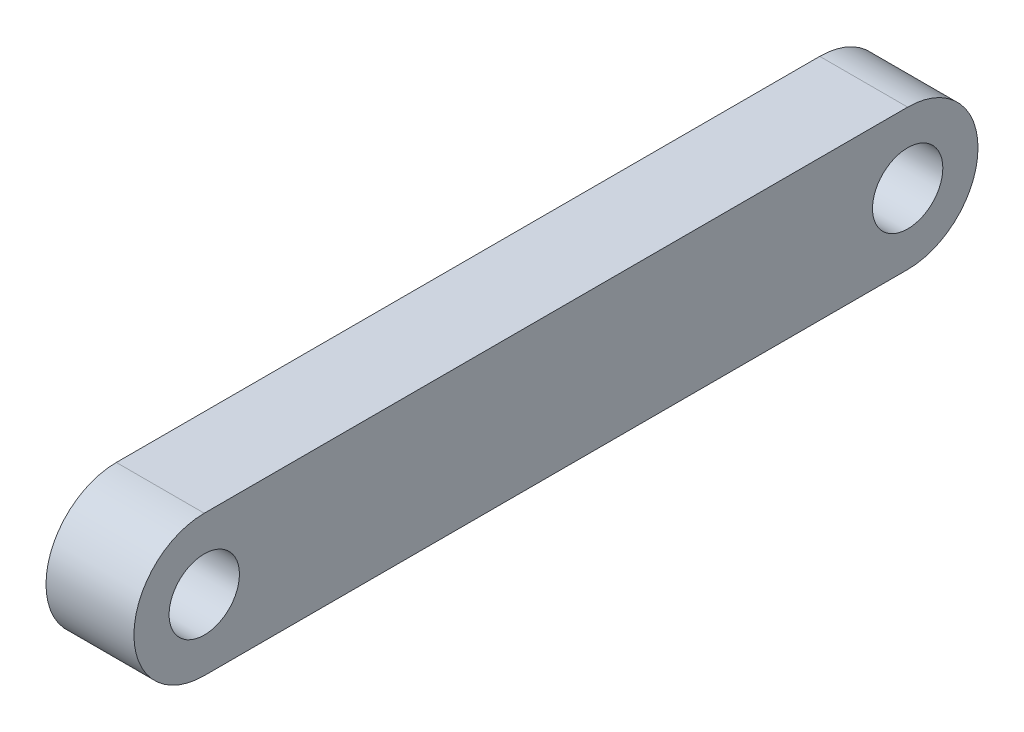
ISO-10303-21;
HEADER;
FILE_DESCRIPTION(('STEP AP214'),'2;1');
FILE_NAME('part.step','',(''),(''),'','','');
FILE_SCHEMA(('AUTOMOTIVE_DESIGN { 1 0 10303 214 1 1 1 1 }'));
ENDSEC;
DATA;
#1=APPLICATION_CONTEXT('core data for automotive mechanical design processes');
#2=APPLICATION_PROTOCOL_DEFINITION('international standard','automotive_design',2000,#1);
#3=PRODUCT_CONTEXT('',#1,'mechanical');
#4=PRODUCT('Part','Part','',(#3));
#5=PRODUCT_RELATED_PRODUCT_CATEGORY('part','',(#4));
#6=PRODUCT_DEFINITION_FORMATION('','',#4);
#7=PRODUCT_DEFINITION_CONTEXT('part definition',#1,'design');
#8=PRODUCT_DEFINITION('design','',#6,#7);
#9=PRODUCT_DEFINITION_SHAPE('','',#8);
#10=(LENGTH_UNIT() NAMED_UNIT(*) SI_UNIT(.MILLI.,.METRE.));
#11=(NAMED_UNIT(*) PLANE_ANGLE_UNIT() SI_UNIT($,.RADIAN.));
#12=(NAMED_UNIT(*) SI_UNIT($,.STERADIAN.) SOLID_ANGLE_UNIT());
#13=UNCERTAINTY_MEASURE_WITH_UNIT(LENGTH_MEASURE(1.E-05),#10,'distance_accuracy_value','');
#14=(GEOMETRIC_REPRESENTATION_CONTEXT(3) GLOBAL_UNCERTAINTY_ASSIGNED_CONTEXT((#13)) GLOBAL_UNIT_ASSIGNED_CONTEXT((#10,
#11,#12)) REPRESENTATION_CONTEXT('',''));
#15=CARTESIAN_POINT('',(0.,0.,0.));
#16=DIRECTION('',(0.,0.,1.));
#17=DIRECTION('',(1.,0.,0.));
#18=AXIS2_PLACEMENT_3D('',#15,#16,#17);
#19=CARTESIAN_POINT('',(10.,-7.99999999999999,0.));
#20=DIRECTION('',(0.,1.,0.));
#21=DIRECTION('',(0.,0.,1.));
#22=AXIS2_PLACEMENT_3D('',#19,#20,#21);
#23=PLANE('',#22);
#24=DIRECTION('',(0.,0.,-1.));
#25=VECTOR('',#24,1.);
#26=CARTESIAN_POINT('',(0.,-7.99999999999999,0.));
#27=LINE('',#26,#25);
#28=CARTESIAN_POINT('',(0.,-7.99999999999999,40.));
#29=VERTEX_POINT('',#28);
#30=CARTESIAN_POINT('',(0.,-7.99999999999999,-40.));
#31=VERTEX_POINT('',#30);
#32=EDGE_CURVE('E109',#29,#31,#27,.T.);
#33=ORIENTED_EDGE('',*,*,#32,.T.);
#34=DIRECTION('',(-1.,0.,0.));
#35=VECTOR('',#34,1.);
#36=CARTESIAN_POINT('',(10.,-7.99999999999999,-40.));
#37=LINE('',#36,#35);
#38=CARTESIAN_POINT('',(10.,-7.99999999999999,-40.));
#39=VERTEX_POINT('',#38);
#40=EDGE_CURVE('E11',#39,#31,#37,.T.);
#41=ORIENTED_EDGE('',*,*,#40,.F.);
#42=DIRECTION('',(0.,0.,-1.));
#43=VECTOR('',#42,1.);
#44=CARTESIAN_POINT('',(10.,-7.99999999999999,0.));
#45=LINE('',#44,#43);
#46=CARTESIAN_POINT('',(10.,-7.99999999999999,40.));
#47=VERTEX_POINT('',#46);
#48=EDGE_CURVE('E89',#47,#39,#45,.T.);
#49=ORIENTED_EDGE('',*,*,#48,.F.);
#50=DIRECTION('',(-1.,0.,0.));
#51=VECTOR('',#50,1.);
#52=CARTESIAN_POINT('',(10.,-7.99999999999999,40.));
#53=LINE('',#52,#51);
#54=EDGE_CURVE('E56',#47,#29,#53,.T.);
#55=ORIENTED_EDGE('',*,*,#54,.T.);
#56=EDGE_LOOP('',(#33,#41,#49,#55));
#57=FACE_BOUND('',#56,.T.);
#58=ADVANCED_FACE('F39',(#57),#23,.F.);
#59=CARTESIAN_POINT('',(10.,0.,-40.));
#60=DIRECTION('',(-1.,0.,0.));
#61=DIRECTION('',(0.,0.,1.));
#62=AXIS2_PLACEMENT_3D('',#59,#60,#61);
#63=CYLINDRICAL_SURFACE('',#62,7.99999999999999);
#64=CARTESIAN_POINT('',(0.,0.,-40.));
#65=DIRECTION('',(1.,0.,0.));
#66=DIRECTION('',(0.,0.,-1.));
#67=AXIS2_PLACEMENT_3D('',#64,#65,#66);
#68=CIRCLE('',#67,7.99999999999999);
#69=CARTESIAN_POINT('',(0.,7.99999999999998,-40.));
#70=VERTEX_POINT('',#69);
#71=EDGE_CURVE('E94',#31,#70,#68,.T.);
#72=ORIENTED_EDGE('',*,*,#71,.T.);
#73=DIRECTION('',(-1.,0.,0.));
#74=VECTOR('',#73,1.);
#75=CARTESIAN_POINT('',(10.,7.99999999999998,-40.));
#76=LINE('',#75,#74);
#77=CARTESIAN_POINT('',(10.,7.99999999999998,-40.));
#78=VERTEX_POINT('',#77);
#79=EDGE_CURVE('E48',#78,#70,#76,.T.);
#80=ORIENTED_EDGE('',*,*,#79,.F.);
#81=CARTESIAN_POINT('',(10.,0.,-40.));
#82=DIRECTION('',(1.,0.,0.));
#83=DIRECTION('',(0.,0.,-1.));
#84=AXIS2_PLACEMENT_3D('',#81,#82,#83);
#85=CIRCLE('',#84,7.99999999999999);
#86=EDGE_CURVE('E81',#39,#78,#85,.T.);
#87=ORIENTED_EDGE('',*,*,#86,.F.);
#88=ORIENTED_EDGE('',*,*,#40,.T.);
#89=EDGE_LOOP('',(#72,#80,#87,#88));
#90=FACE_BOUND('',#89,.T.);
#91=ADVANCED_FACE('F93',(#90),#63,.T.);
#92=CARTESIAN_POINT('',(10.,7.99999999999998,0.));
#93=DIRECTION('',(0.,1.,0.));
#94=DIRECTION('',(0.,0.,1.));
#95=AXIS2_PLACEMENT_3D('',#92,#93,#94);
#96=PLANE('',#95);
#97=DIRECTION('',(0.,0.,-1.));
#98=VECTOR('',#97,1.);
#99=CARTESIAN_POINT('',(0.,7.99999999999998,0.));
#100=LINE('',#99,#98);
#101=CARTESIAN_POINT('',(0.,7.99999999999998,40.));
#102=VERTEX_POINT('',#101);
#103=EDGE_CURVE('E112',#102,#70,#100,.T.);
#104=ORIENTED_EDGE('',*,*,#103,.F.);
#105=DIRECTION('',(-1.,0.,0.));
#106=VECTOR('',#105,1.);
#107=CARTESIAN_POINT('',(10.,7.99999999999998,40.));
#108=LINE('',#107,#106);
#109=CARTESIAN_POINT('',(10.,7.99999999999998,40.));
#110=VERTEX_POINT('',#109);
#111=EDGE_CURVE('E70',#110,#102,#108,.T.);
#112=ORIENTED_EDGE('',*,*,#111,.F.);
#113=DIRECTION('',(0.,0.,-1.));
#114=VECTOR('',#113,1.);
#115=CARTESIAN_POINT('',(10.,7.99999999999998,0.));
#116=LINE('',#115,#114);
#117=EDGE_CURVE('E88',#110,#78,#116,.T.);
#118=ORIENTED_EDGE('',*,*,#117,.T.);
#119=ORIENTED_EDGE('',*,*,#79,.T.);
#120=EDGE_LOOP('',(#104,#112,#118,#119));
#121=FACE_BOUND('',#120,.T.);
#122=ADVANCED_FACE('F97',(#121),#96,.T.);
#123=CARTESIAN_POINT('',(10.,0.,40.));
#124=DIRECTION('',(-1.,0.,0.));
#125=DIRECTION('',(0.,0.,1.));
#126=AXIS2_PLACEMENT_3D('',#123,#124,#125);
#127=CYLINDRICAL_SURFACE('',#126,4.00000000000001);
#128=CARTESIAN_POINT('',(10.,0.,40.));
#129=DIRECTION('',(1.,0.,0.));
#130=DIRECTION('',(0.,0.,-1.));
#131=AXIS2_PLACEMENT_3D('',#128,#129,#130);
#132=CIRCLE('',#131,4.00000000000001);
#133=CARTESIAN_POINT('',(10.,0.,36.));
#134=VERTEX_POINT('',#133);
#135=EDGE_CURVE('E121',#134,#134,#132,.T.);
#136=ORIENTED_EDGE('',*,*,#135,.T.);
#137=EDGE_LOOP('',(#136));
#138=FACE_BOUND('',#137,.T.);
#139=CARTESIAN_POINT('',(0.,0.,40.));
#140=DIRECTION('',(1.,0.,0.));
#141=DIRECTION('',(0.,0.,-1.));
#142=AXIS2_PLACEMENT_3D('',#139,#140,#141);
#143=CIRCLE('',#142,4.00000000000001);
#144=CARTESIAN_POINT('',(0.,0.,36.));
#145=VERTEX_POINT('',#144);
#146=EDGE_CURVE('E106',#145,#145,#143,.T.);
#147=ORIENTED_EDGE('',*,*,#146,.F.);
#148=EDGE_LOOP('',(#147));
#149=FACE_BOUND('',#148,.T.);
#150=ADVANCED_FACE('F129',(#138,#149),#127,.F.);
#151=CARTESIAN_POINT('',(10.,0.,-40.));
#152=DIRECTION('',(-1.,0.,0.));
#153=DIRECTION('',(0.,0.,1.));
#154=AXIS2_PLACEMENT_3D('',#151,#152,#153);
#155=CYLINDRICAL_SURFACE('',#154,4.00000000000001);
#156=CARTESIAN_POINT('',(10.,0.,-40.));
#157=DIRECTION('',(1.,0.,0.));
#158=DIRECTION('',(0.,0.,-1.));
#159=AXIS2_PLACEMENT_3D('',#156,#157,#158);
#160=CIRCLE('',#159,4.00000000000001);
#161=CARTESIAN_POINT('',(10.,0.,-44.));
#162=VERTEX_POINT('',#161);
#163=EDGE_CURVE('E117',#162,#162,#160,.F.);
#164=ORIENTED_EDGE('',*,*,#163,.F.);
#165=EDGE_LOOP('',(#164));
#166=FACE_BOUND('',#165,.T.);
#167=CARTESIAN_POINT('',(0.,0.,-40.));
#168=DIRECTION('',(1.,0.,0.));
#169=DIRECTION('',(0.,0.,-1.));
#170=AXIS2_PLACEMENT_3D('',#167,#168,#169);
#171=CIRCLE('',#170,4.00000000000001);
#172=CARTESIAN_POINT('',(0.,0.,-44.));
#173=VERTEX_POINT('',#172);
#174=EDGE_CURVE('E103',#173,#173,#171,.F.);
#175=ORIENTED_EDGE('',*,*,#174,.T.);
#176=EDGE_LOOP('',(#175));
#177=FACE_BOUND('',#176,.T.);
#178=ADVANCED_FACE('F41',(#166,#177),#155,.F.);
#179=CARTESIAN_POINT('',(10.,0.,40.));
#180=DIRECTION('',(-1.,0.,0.));
#181=DIRECTION('',(0.,0.,1.));
#182=AXIS2_PLACEMENT_3D('',#179,#180,#181);
#183=CYLINDRICAL_SURFACE('',#182,7.99999999999999);
#184=CARTESIAN_POINT('',(0.,0.,40.));
#185=DIRECTION('',(1.,0.,0.));
#186=DIRECTION('',(0.,0.,-1.));
#187=AXIS2_PLACEMENT_3D('',#184,#185,#186);
#188=CIRCLE('',#187,7.99999999999999);
#189=EDGE_CURVE('E114',#29,#102,#188,.F.);
#190=ORIENTED_EDGE('',*,*,#189,.F.);
#191=ORIENTED_EDGE('',*,*,#54,.F.);
#192=CARTESIAN_POINT('',(10.,0.,40.));
#193=DIRECTION('',(1.,0.,0.));
#194=DIRECTION('',(0.,0.,-1.));
#195=AXIS2_PLACEMENT_3D('',#192,#193,#194);
#196=CIRCLE('',#195,7.99999999999999);
#197=EDGE_CURVE('E98',#47,#110,#196,.F.);
#198=ORIENTED_EDGE('',*,*,#197,.T.);
#199=ORIENTED_EDGE('',*,*,#111,.T.);
#200=EDGE_LOOP('',(#190,#191,#198,#199));
#201=FACE_BOUND('',#200,.T.);
#202=ADVANCED_FACE('F134',(#201),#183,.T.);
#203=CARTESIAN_POINT('',(10.,0.,0.));
#204=DIRECTION('',(1.,0.,0.));
#205=DIRECTION('',(0.,0.,-1.));
#206=AXIS2_PLACEMENT_3D('',#203,#204,#205);
#207=PLANE('',#206);
#208=ORIENTED_EDGE('',*,*,#163,.T.);
#209=EDGE_LOOP('',(#208));
#210=FACE_BOUND('',#209,.T.);
#211=ORIENTED_EDGE('',*,*,#135,.F.);
#212=EDGE_LOOP('',(#211));
#213=FACE_BOUND('',#212,.T.);
#214=ORIENTED_EDGE('',*,*,#48,.T.);
#215=ORIENTED_EDGE('',*,*,#86,.T.);
#216=ORIENTED_EDGE('',*,*,#117,.F.);
#217=ORIENTED_EDGE('',*,*,#197,.F.);
#218=EDGE_LOOP('',(#214,#215,#216,#217));
#219=FACE_BOUND('',#218,.T.);
#220=ADVANCED_FACE('F85',(#210,#213,#219),#207,.T.);
#221=CARTESIAN_POINT('',(0.,0.,0.));
#222=DIRECTION('',(1.,0.,0.));
#223=DIRECTION('',(0.,0.,-1.));
#224=AXIS2_PLACEMENT_3D('',#221,#222,#223);
#225=PLANE('',#224);
#226=ORIENTED_EDGE('',*,*,#174,.F.);
#227=EDGE_LOOP('',(#226));
#228=FACE_BOUND('',#227,.T.);
#229=ORIENTED_EDGE('',*,*,#146,.T.);
#230=EDGE_LOOP('',(#229));
#231=FACE_BOUND('',#230,.T.);
#232=ORIENTED_EDGE('',*,*,#32,.F.);
#233=ORIENTED_EDGE('',*,*,#189,.T.);
#234=ORIENTED_EDGE('',*,*,#103,.T.);
#235=ORIENTED_EDGE('',*,*,#71,.F.);
#236=EDGE_LOOP('',(#232,#233,#234,#235));
#237=FACE_BOUND('',#236,.T.);
#238=ADVANCED_FACE('F133',(#228,#231,#237),#225,.F.);
#239=CLOSED_SHELL('',(#58,#91,#122,#150,#178,#202,#220,#238));
#240=MANIFOLD_SOLID_BREP('B2',#239);
#241=ADVANCED_BREP_SHAPE_REPRESENTATION('',(#18,#240),#14);
#242=SHAPE_DEFINITION_REPRESENTATION(#9,#241);
ENDSEC;
END-ISO-10303-21;
